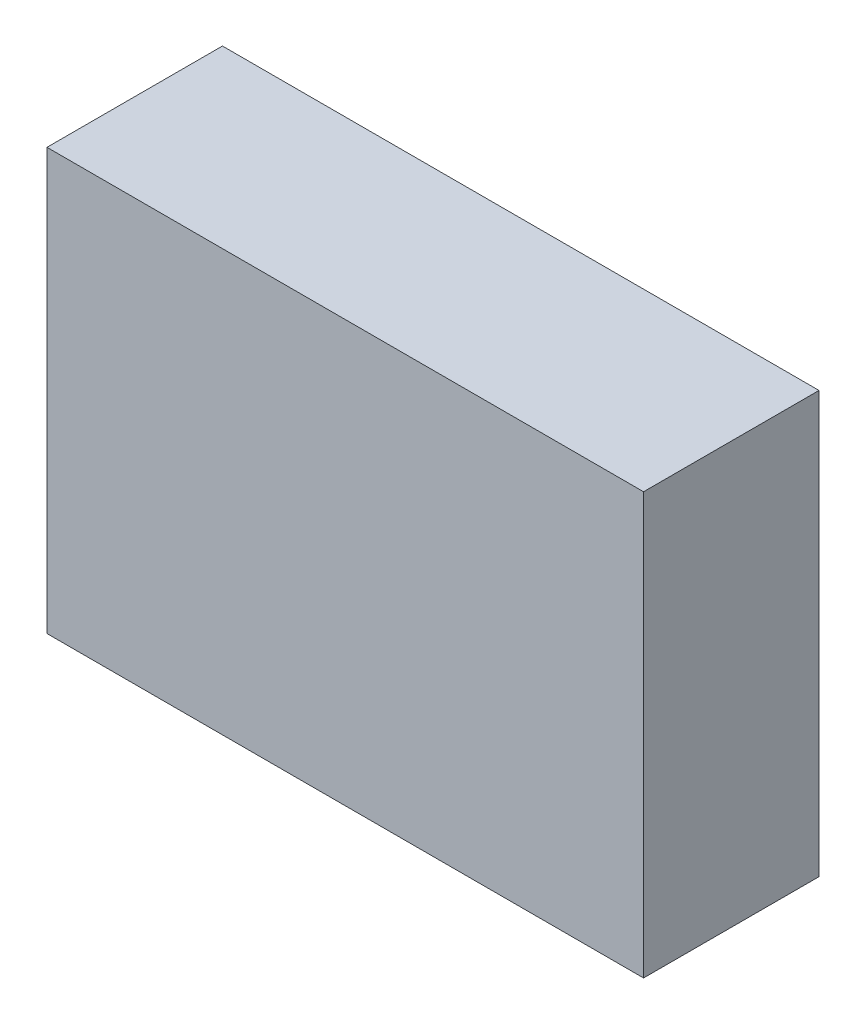
ISO-10303-21;
HEADER;
FILE_DESCRIPTION(('STEP AP214'),'2;1');
FILE_NAME('part.step','',(''),(''),'','','');
FILE_SCHEMA(('AUTOMOTIVE_DESIGN { 1 0 10303 214 1 1 1 1 }'));
ENDSEC;
DATA;
#1=APPLICATION_CONTEXT('core data for automotive mechanical design processes');
#2=APPLICATION_PROTOCOL_DEFINITION('international standard','automotive_design',2000,#1);
#3=PRODUCT_CONTEXT('',#1,'mechanical');
#4=PRODUCT('Part','Part','',(#3));
#5=PRODUCT_RELATED_PRODUCT_CATEGORY('part','',(#4));
#6=PRODUCT_DEFINITION_FORMATION('','',#4);
#7=PRODUCT_DEFINITION_CONTEXT('part definition',#1,'design');
#8=PRODUCT_DEFINITION('design','',#6,#7);
#9=PRODUCT_DEFINITION_SHAPE('','',#8);
#10=(LENGTH_UNIT() NAMED_UNIT(*) SI_UNIT(.MILLI.,.METRE.));
#11=(NAMED_UNIT(*) PLANE_ANGLE_UNIT() SI_UNIT($,.RADIAN.));
#12=(NAMED_UNIT(*) SI_UNIT($,.STERADIAN.) SOLID_ANGLE_UNIT());
#13=UNCERTAINTY_MEASURE_WITH_UNIT(LENGTH_MEASURE(1.E-05),#10,'distance_accuracy_value','');
#14=(GEOMETRIC_REPRESENTATION_CONTEXT(3) GLOBAL_UNCERTAINTY_ASSIGNED_CONTEXT((#13)) GLOBAL_UNIT_ASSIGNED_CONTEXT((#10,
#11,#12)) REPRESENTATION_CONTEXT('',''));
#15=CARTESIAN_POINT('',(0.,0.,0.));
#16=DIRECTION('',(0.,0.,1.));
#17=DIRECTION('',(1.,0.,0.));
#18=AXIS2_PLACEMENT_3D('',#15,#16,#17);
#19=CARTESIAN_POINT('',(-2.92,-0.87,0.));
#20=DIRECTION('',(1.,0.,0.));
#21=DIRECTION('',(0.,0.,1.));
#22=AXIS2_PLACEMENT_3D('',#19,#20,#21);
#23=PLANE('',#22);
#24=DIRECTION('',(0.,1.,0.));
#25=VECTOR('',#24,1.);
#26=CARTESIAN_POINT('',(-2.92,-0.87,0.1));
#27=LINE('',#26,#25);
#28=CARTESIAN_POINT('',(-2.92,-0.87,0.1));
#29=VERTEX_POINT('',#28);
#30=CARTESIAN_POINT('',(-2.92,-0.63,0.1));
#31=VERTEX_POINT('',#30);
#32=EDGE_CURVE('E11',#29,#31,#27,.T.);
#33=ORIENTED_EDGE('',*,*,#32,.T.);
#34=DIRECTION('',(0.,0.,1.));
#35=VECTOR('',#34,1.);
#36=CARTESIAN_POINT('',(-2.92,-0.63,0.));
#37=LINE('',#36,#35);
#38=CARTESIAN_POINT('',(-2.92,-0.63,0.));
#39=VERTEX_POINT('',#38);
#40=EDGE_CURVE('E24',#39,#31,#37,.T.);
#41=ORIENTED_EDGE('',*,*,#40,.F.);
#42=DIRECTION('',(0.,1.,0.));
#43=VECTOR('',#42,1.);
#44=CARTESIAN_POINT('',(-2.92,-0.87,0.));
#45=LINE('',#44,#43);
#46=CARTESIAN_POINT('',(-2.92,-0.87,0.));
#47=VERTEX_POINT('',#46);
#48=EDGE_CURVE('E86',#47,#39,#45,.T.);
#49=ORIENTED_EDGE('',*,*,#48,.F.);
#50=DIRECTION('',(0.,0.,1.));
#51=VECTOR('',#50,1.);
#52=CARTESIAN_POINT('',(-2.92,-0.87,0.));
#53=LINE('',#52,#51);
#54=EDGE_CURVE('E36',#47,#29,#53,.T.);
#55=ORIENTED_EDGE('',*,*,#54,.T.);
#56=EDGE_LOOP('',(#33,#41,#49,#55));
#57=FACE_BOUND('',#56,.T.);
#58=ADVANCED_FACE('F17',(#57),#23,.F.);
#59=CARTESIAN_POINT('',(-2.58,-0.87,0.));
#60=DIRECTION('',(1.,0.,0.));
#61=DIRECTION('',(0.,0.,1.));
#62=AXIS2_PLACEMENT_3D('',#59,#60,#61);
#63=PLANE('',#62);
#64=DIRECTION('',(0.,0.,1.));
#65=VECTOR('',#64,1.);
#66=CARTESIAN_POINT('',(-2.58,-0.87,0.));
#67=LINE('',#66,#65);
#68=CARTESIAN_POINT('',(-2.58,-0.87,0.));
#69=VERTEX_POINT('',#68);
#70=CARTESIAN_POINT('',(-2.58,-0.87,0.1));
#71=VERTEX_POINT('',#70);
#72=EDGE_CURVE('E83',#69,#71,#67,.T.);
#73=ORIENTED_EDGE('',*,*,#72,.F.);
#74=DIRECTION('',(0.,1.,0.));
#75=VECTOR('',#74,1.);
#76=CARTESIAN_POINT('',(-2.58,-0.87,0.));
#77=LINE('',#76,#75);
#78=CARTESIAN_POINT('',(-2.58,-0.63,0.));
#79=VERTEX_POINT('',#78);
#80=EDGE_CURVE('E63',#69,#79,#77,.T.);
#81=ORIENTED_EDGE('',*,*,#80,.T.);
#82=DIRECTION('',(0.,0.,1.));
#83=VECTOR('',#82,1.);
#84=CARTESIAN_POINT('',(-2.58,-0.63,0.));
#85=LINE('',#84,#83);
#86=CARTESIAN_POINT('',(-2.58,-0.63,0.1));
#87=VERTEX_POINT('',#86);
#88=EDGE_CURVE('E57',#79,#87,#85,.T.);
#89=ORIENTED_EDGE('',*,*,#88,.T.);
#90=DIRECTION('',(0.,1.,0.));
#91=VECTOR('',#90,1.);
#92=CARTESIAN_POINT('',(-2.58,-0.87,0.1));
#93=LINE('',#92,#91);
#94=EDGE_CURVE('E60',#71,#87,#93,.T.);
#95=ORIENTED_EDGE('',*,*,#94,.F.);
#96=EDGE_LOOP('',(#73,#81,#89,#95));
#97=FACE_BOUND('',#96,.T.);
#98=ADVANCED_FACE('F59',(#97),#63,.T.);
#99=CARTESIAN_POINT('',(-2.92,-0.87,0.));
#100=DIRECTION('',(0.,1.,0.));
#101=DIRECTION('',(0.,0.,1.));
#102=AXIS2_PLACEMENT_3D('',#99,#100,#101);
#103=PLANE('',#102);
#104=ORIENTED_EDGE('',*,*,#72,.T.);
#105=DIRECTION('',(1.,0.,0.));
#106=VECTOR('',#105,1.);
#107=CARTESIAN_POINT('',(-2.92,-0.87,0.1));
#108=LINE('',#107,#106);
#109=EDGE_CURVE('E71',#29,#71,#108,.T.);
#110=ORIENTED_EDGE('',*,*,#109,.F.);
#111=ORIENTED_EDGE('',*,*,#54,.F.);
#112=DIRECTION('',(1.,0.,0.));
#113=VECTOR('',#112,1.);
#114=CARTESIAN_POINT('',(-2.92,-0.87,0.));
#115=LINE('',#114,#113);
#116=EDGE_CURVE('E76',#47,#69,#115,.T.);
#117=ORIENTED_EDGE('',*,*,#116,.T.);
#118=EDGE_LOOP('',(#104,#110,#111,#117));
#119=FACE_BOUND('',#118,.T.);
#120=ADVANCED_FACE('F91',(#119),#103,.F.);
#121=CARTESIAN_POINT('',(-2.92,-0.63,0.));
#122=DIRECTION('',(0.,1.,0.));
#123=DIRECTION('',(0.,0.,1.));
#124=AXIS2_PLACEMENT_3D('',#121,#122,#123);
#125=PLANE('',#124);
#126=DIRECTION('',(1.,0.,0.));
#127=VECTOR('',#126,1.);
#128=CARTESIAN_POINT('',(-2.92,-0.63,0.));
#129=LINE('',#128,#127);
#130=EDGE_CURVE('E74',#39,#79,#129,.T.);
#131=ORIENTED_EDGE('',*,*,#130,.F.);
#132=ORIENTED_EDGE('',*,*,#40,.T.);
#133=DIRECTION('',(1.,0.,0.));
#134=VECTOR('',#133,1.);
#135=CARTESIAN_POINT('',(-2.92,-0.63,0.1));
#136=LINE('',#135,#134);
#137=EDGE_CURVE('E69',#31,#87,#136,.T.);
#138=ORIENTED_EDGE('',*,*,#137,.T.);
#139=ORIENTED_EDGE('',*,*,#88,.F.);
#140=EDGE_LOOP('',(#131,#132,#138,#139));
#141=FACE_BOUND('',#140,.T.);
#142=ADVANCED_FACE('F73',(#141),#125,.T.);
#143=CARTESIAN_POINT('',(-2.92,-0.87,0.));
#144=DIRECTION('',(0.,0.,1.));
#145=DIRECTION('',(1.,0.,0.));
#146=AXIS2_PLACEMENT_3D('',#143,#144,#145);
#147=PLANE('',#146);
#148=ORIENTED_EDGE('',*,*,#130,.T.);
#149=ORIENTED_EDGE('',*,*,#80,.F.);
#150=ORIENTED_EDGE('',*,*,#116,.F.);
#151=ORIENTED_EDGE('',*,*,#48,.T.);
#152=EDGE_LOOP('',(#148,#149,#150,#151));
#153=FACE_BOUND('',#152,.T.);
#154=ADVANCED_FACE('F89',(#153),#147,.F.);
#155=CARTESIAN_POINT('',(-2.92,-0.87,0.1));
#156=DIRECTION('',(0.,0.,1.));
#157=DIRECTION('',(1.,0.,0.));
#158=AXIS2_PLACEMENT_3D('',#155,#156,#157);
#159=PLANE('',#158);
#160=ORIENTED_EDGE('',*,*,#32,.F.);
#161=ORIENTED_EDGE('',*,*,#109,.T.);
#162=ORIENTED_EDGE('',*,*,#94,.T.);
#163=ORIENTED_EDGE('',*,*,#137,.F.);
#164=EDGE_LOOP('',(#160,#161,#162,#163));
#165=FACE_BOUND('',#164,.T.);
#166=ADVANCED_FACE('F68',(#165),#159,.T.);
#167=CLOSED_SHELL('',(#58,#98,#120,#142,#154,#166));
#168=MANIFOLD_SOLID_BREP('B1',#167);
#169=ADVANCED_BREP_SHAPE_REPRESENTATION('',(#18,#168),#14);
#170=SHAPE_DEFINITION_REPRESENTATION(#9,#169);
ENDSEC;
END-ISO-10303-21;
